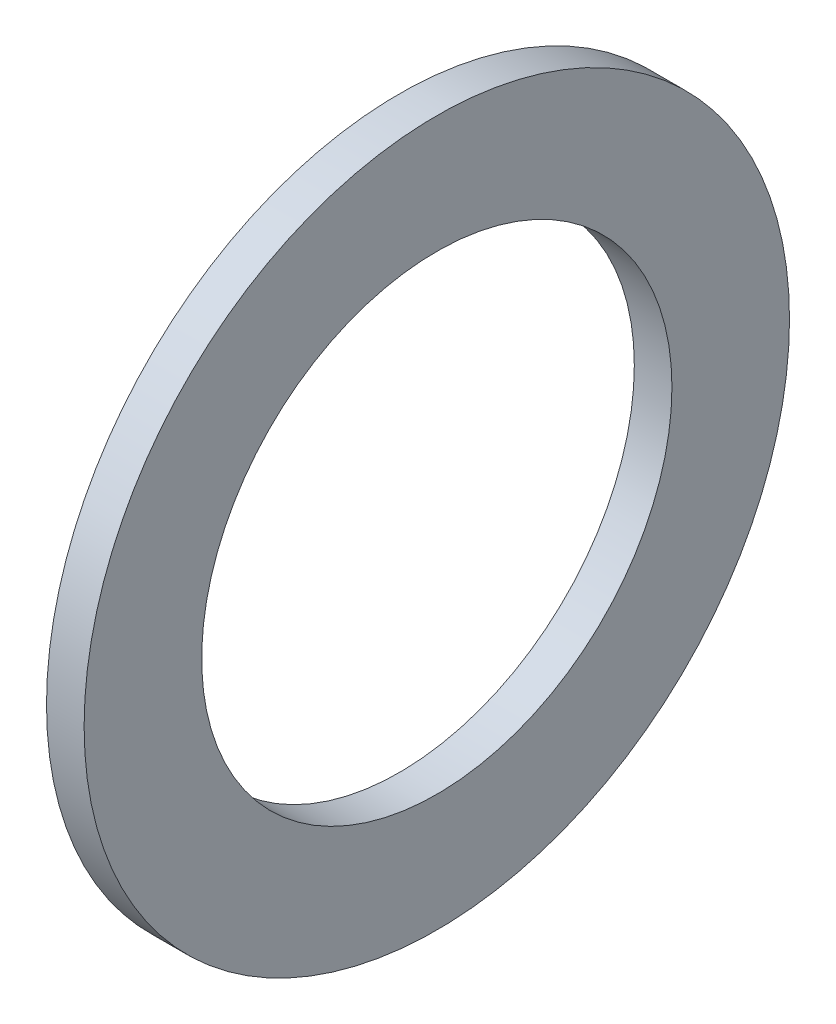
ISO-10303-21;
HEADER;
FILE_DESCRIPTION(('STEP AP214'),'2;1');
FILE_NAME('part.step','',(''),(''),'','','');
FILE_SCHEMA(('AUTOMOTIVE_DESIGN { 1 0 10303 214 1 1 1 1 }'));
ENDSEC;
DATA;
#1=APPLICATION_CONTEXT('core data for automotive mechanical design processes');
#2=APPLICATION_PROTOCOL_DEFINITION('international standard','automotive_design',2000,#1);
#3=PRODUCT_CONTEXT('',#1,'mechanical');
#4=PRODUCT('Part','Part','',(#3));
#5=PRODUCT_RELATED_PRODUCT_CATEGORY('part','',(#4));
#6=PRODUCT_DEFINITION_FORMATION('','',#4);
#7=PRODUCT_DEFINITION_CONTEXT('part definition',#1,'design');
#8=PRODUCT_DEFINITION('design','',#6,#7);
#9=PRODUCT_DEFINITION_SHAPE('','',#8);
#10=(LENGTH_UNIT() NAMED_UNIT(*) SI_UNIT(.MILLI.,.METRE.));
#11=(NAMED_UNIT(*) PLANE_ANGLE_UNIT() SI_UNIT($,.RADIAN.));
#12=(NAMED_UNIT(*) SI_UNIT($,.STERADIAN.) SOLID_ANGLE_UNIT());
#13=UNCERTAINTY_MEASURE_WITH_UNIT(LENGTH_MEASURE(1.E-05),#10,'distance_accuracy_value','');
#14=(GEOMETRIC_REPRESENTATION_CONTEXT(3) GLOBAL_UNCERTAINTY_ASSIGNED_CONTEXT((#13)) GLOBAL_UNIT_ASSIGNED_CONTEXT((#10,
#11,#12)) REPRESENTATION_CONTEXT('',''));
#15=CARTESIAN_POINT('',(0.,0.,0.));
#16=DIRECTION('',(0.,0.,1.));
#17=DIRECTION('',(1.,0.,0.));
#18=AXIS2_PLACEMENT_3D('',#15,#16,#17);
#19=CARTESIAN_POINT('',(0.508,0.,0.));
#20=DIRECTION('',(1.,0.,0.));
#21=DIRECTION('',(0.,0.,-1.));
#22=AXIS2_PLACEMENT_3D('',#19,#20,#21);
#23=PLANE('',#22);
#24=CARTESIAN_POINT('',(0.508,0.,0.));
#25=DIRECTION('',(1.,0.,0.));
#26=DIRECTION('',(0.,0.,-1.));
#27=AXIS2_PLACEMENT_3D('',#24,#25,#26);
#28=CIRCLE('',#27,4.7625);
#29=CARTESIAN_POINT('',(0.508,0.,-4.7625));
#30=VERTEX_POINT('',#29);
#31=EDGE_CURVE('E10',#30,#30,#28,.T.);
#32=ORIENTED_EDGE('',*,*,#31,.T.);
#33=EDGE_LOOP('',(#32));
#34=FACE_BOUND('',#33,.T.);
#35=CARTESIAN_POINT('',(0.508,0.,0.));
#36=DIRECTION('',(1.,0.,0.));
#37=DIRECTION('',(0.,0.,-1.));
#38=AXIS2_PLACEMENT_3D('',#35,#36,#37);
#39=CIRCLE('',#38,3.175);
#40=CARTESIAN_POINT('',(0.508,0.,-3.175));
#41=VERTEX_POINT('',#40);
#42=EDGE_CURVE('E39',#41,#41,#39,.T.);
#43=ORIENTED_EDGE('',*,*,#42,.F.);
#44=EDGE_LOOP('',(#43));
#45=FACE_BOUND('',#44,.T.);
#46=ADVANCED_FACE('F28',(#34,#45),#23,.T.);
#47=CARTESIAN_POINT('',(0.,0.,0.));
#48=DIRECTION('',(1.,0.,0.));
#49=DIRECTION('',(0.,0.,-1.));
#50=AXIS2_PLACEMENT_3D('',#47,#48,#49);
#51=PLANE('',#50);
#52=CARTESIAN_POINT('',(0.,0.,0.));
#53=DIRECTION('',(1.,0.,0.));
#54=DIRECTION('',(0.,0.,-1.));
#55=AXIS2_PLACEMENT_3D('',#52,#53,#54);
#56=CIRCLE('',#55,4.7625);
#57=CARTESIAN_POINT('',(0.,0.,-4.7625));
#58=VERTEX_POINT('',#57);
#59=EDGE_CURVE('E32',#58,#58,#56,.T.);
#60=ORIENTED_EDGE('',*,*,#59,.F.);
#61=EDGE_LOOP('',(#60));
#62=FACE_BOUND('',#61,.T.);
#63=CARTESIAN_POINT('',(0.,0.,0.));
#64=DIRECTION('',(1.,0.,0.));
#65=DIRECTION('',(0.,0.,-1.));
#66=AXIS2_PLACEMENT_3D('',#63,#64,#65);
#67=CIRCLE('',#66,3.175);
#68=CARTESIAN_POINT('',(0.,0.,-3.175));
#69=VERTEX_POINT('',#68);
#70=EDGE_CURVE('E41',#69,#69,#67,.T.);
#71=ORIENTED_EDGE('',*,*,#70,.T.);
#72=EDGE_LOOP('',(#71));
#73=FACE_BOUND('',#72,.T.);
#74=ADVANCED_FACE('F51',(#62,#73),#51,.F.);
#75=CARTESIAN_POINT('',(0.508,0.,0.));
#76=DIRECTION('',(-1.,0.,0.));
#77=DIRECTION('',(0.,0.,1.));
#78=AXIS2_PLACEMENT_3D('',#75,#76,#77);
#79=CYLINDRICAL_SURFACE('',#78,4.7625);
#80=ORIENTED_EDGE('',*,*,#31,.F.);
#81=EDGE_LOOP('',(#80));
#82=FACE_BOUND('',#81,.T.);
#83=ORIENTED_EDGE('',*,*,#59,.T.);
#84=EDGE_LOOP('',(#83));
#85=FACE_BOUND('',#84,.T.);
#86=ADVANCED_FACE('F30',(#82,#85),#79,.T.);
#87=CARTESIAN_POINT('',(0.508,0.,0.));
#88=DIRECTION('',(-1.,0.,0.));
#89=DIRECTION('',(0.,0.,1.));
#90=AXIS2_PLACEMENT_3D('',#87,#88,#89);
#91=CYLINDRICAL_SURFACE('',#90,3.175);
#92=ORIENTED_EDGE('',*,*,#42,.T.);
#93=EDGE_LOOP('',(#92));
#94=FACE_BOUND('',#93,.T.);
#95=ORIENTED_EDGE('',*,*,#70,.F.);
#96=EDGE_LOOP('',(#95));
#97=FACE_BOUND('',#96,.T.);
#98=ADVANCED_FACE('F47',(#94,#97),#91,.F.);
#99=CLOSED_SHELL('',(#46,#74,#86,#98));
#100=MANIFOLD_SOLID_BREP('B2',#99);
#101=ADVANCED_BREP_SHAPE_REPRESENTATION('',(#18,#100),#14);
#102=SHAPE_DEFINITION_REPRESENTATION(#9,#101);
ENDSEC;
END-ISO-10303-21;
